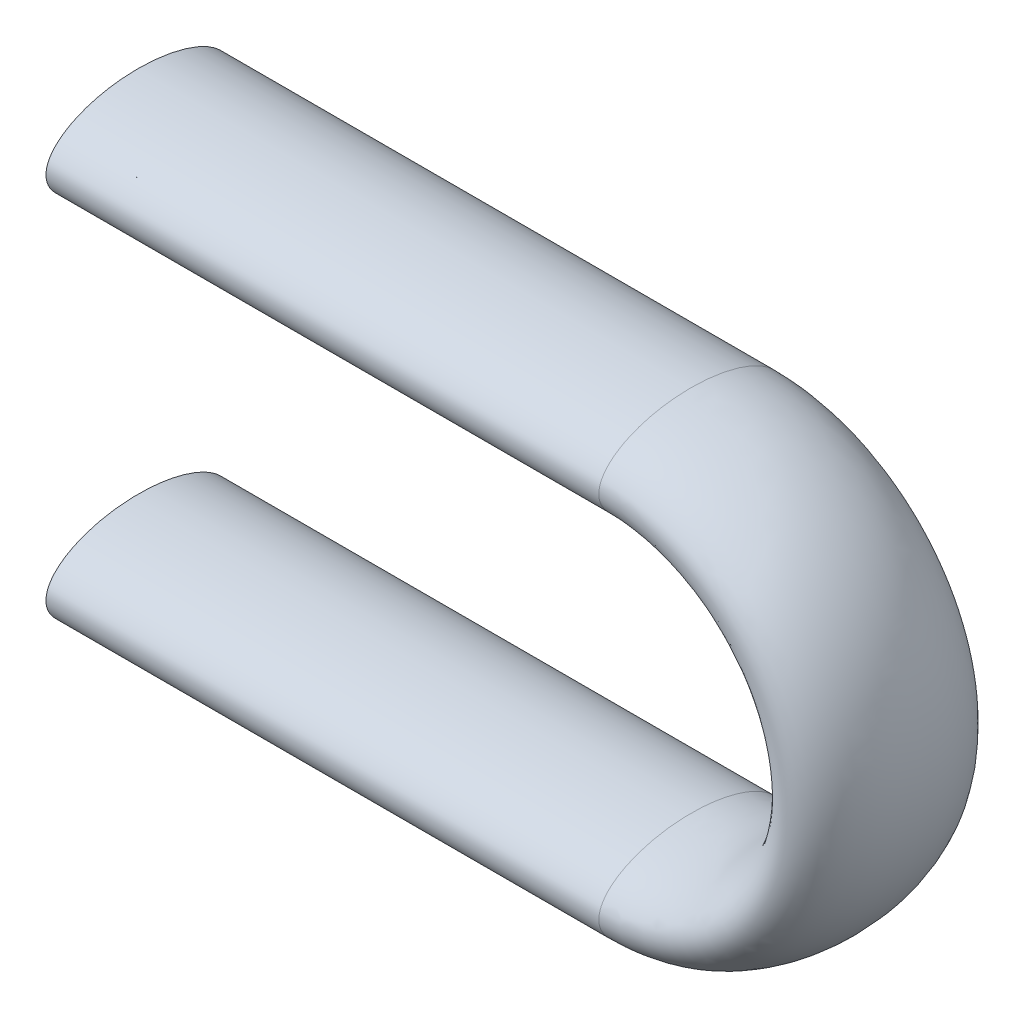
ISO-10303-21;
HEADER;
FILE_DESCRIPTION(('STEP AP214'),'2;1');
FILE_NAME('part.step','',(''),(''),'','','');
FILE_SCHEMA(('AUTOMOTIVE_DESIGN { 1 0 10303 214 1 1 1 1 }'));
ENDSEC;
DATA;
#1=APPLICATION_CONTEXT('core data for automotive mechanical design processes');
#2=APPLICATION_PROTOCOL_DEFINITION('international standard','automotive_design',2000,#1);
#3=PRODUCT_CONTEXT('',#1,'mechanical');
#4=PRODUCT('Part','Part','',(#3));
#5=PRODUCT_RELATED_PRODUCT_CATEGORY('part','',(#4));
#6=PRODUCT_DEFINITION_FORMATION('','',#4);
#7=PRODUCT_DEFINITION_CONTEXT('part definition',#1,'design');
#8=PRODUCT_DEFINITION('design','',#6,#7);
#9=PRODUCT_DEFINITION_SHAPE('','',#8);
#10=(LENGTH_UNIT() NAMED_UNIT(*) SI_UNIT(.MILLI.,.METRE.));
#11=(NAMED_UNIT(*) PLANE_ANGLE_UNIT() SI_UNIT($,.RADIAN.));
#12=(NAMED_UNIT(*) SI_UNIT($,.STERADIAN.) SOLID_ANGLE_UNIT());
#13=UNCERTAINTY_MEASURE_WITH_UNIT(LENGTH_MEASURE(1.E-05),#10,'distance_accuracy_value','');
#14=(GEOMETRIC_REPRESENTATION_CONTEXT(3) GLOBAL_UNCERTAINTY_ASSIGNED_CONTEXT((#13)) GLOBAL_UNIT_ASSIGNED_CONTEXT((#10,
#11,#12)) REPRESENTATION_CONTEXT('',''));
#15=CARTESIAN_POINT('',(0.,0.,0.));
#16=DIRECTION('',(0.,0.,1.));
#17=DIRECTION('',(1.,0.,0.));
#18=AXIS2_PLACEMENT_3D('',#15,#16,#17);
#19=CARTESIAN_POINT('',(0.,203.2,0.));
#20=DIRECTION('',(-1.,0.,0.));
#21=DIRECTION('',(0.,0.,-1.));
#22=AXIS2_PLACEMENT_3D('',#19,#20,#21);
#23=PLANE('',#22);
#24=CARTESIAN_POINT('',(0.,203.2,0.));
#25=DIRECTION('',(-1.,0.,0.));
#26=DIRECTION('',(0.,-1.,0.));
#27=AXIS2_PLACEMENT_3D('',#24,#25,#26);
#28=CIRCLE('',#27,19.05);
#29=CARTESIAN_POINT('',(0.,184.15,0.));
#30=VERTEX_POINT('',#29);
#31=EDGE_CURVE('E51',#30,#30,#28,.F.);
#32=ORIENTED_EDGE('',*,*,#31,.T.);
#33=EDGE_LOOP('',(#32));
#34=FACE_BOUND('',#33,.T.);
#35=CARTESIAN_POINT('',(0.,203.2,0.));
#36=DIRECTION('',(-1.,0.,0.));
#37=DIRECTION('',(0.,0.,-1.));
#38=AXIS2_PLACEMENT_3D('',#35,#36,#37);
#39=ELLIPSE('',#38,50.8,25.4);
#40=CARTESIAN_POINT('',(0.,203.2,-50.8));
#41=VERTEX_POINT('',#40);
#42=EDGE_CURVE('E45',#41,#41,#39,.T.);
#43=ORIENTED_EDGE('',*,*,#42,.T.);
#44=EDGE_LOOP('',(#43));
#45=FACE_BOUND('',#44,.T.);
#46=ADVANCED_FACE('F31',(#34,#45),#23,.T.);
#47=CARTESIAN_POINT('',(0.,0.,0.));
#48=DIRECTION('',(1.,0.,0.));
#49=DIRECTION('',(0.,0.,-1.));
#50=AXIS2_PLACEMENT_3D('',#47,#48,#49);
#51=PLANE('',#50);
#52=CARTESIAN_POINT('',(0.,0.,0.));
#53=DIRECTION('',(1.,0.,0.));
#54=DIRECTION('',(0.,0.,-1.));
#55=AXIS2_PLACEMENT_3D('',#52,#53,#54);
#56=CIRCLE('',#55,19.05);
#57=CARTESIAN_POINT('',(0.,0.,-19.05));
#58=VERTEX_POINT('',#57);
#59=EDGE_CURVE('E50',#58,#58,#56,.F.);
#60=ORIENTED_EDGE('',*,*,#59,.F.);
#61=EDGE_LOOP('',(#60));
#62=FACE_BOUND('',#61,.T.);
#63=CARTESIAN_POINT('',(0.,0.,0.));
#64=DIRECTION('',(1.,0.,0.));
#65=DIRECTION('',(0.,0.,-1.));
#66=AXIS2_PLACEMENT_3D('',#63,#64,#65);
#67=ELLIPSE('',#66,50.8,25.4);
#68=CARTESIAN_POINT('',(0.,0.,-50.8));
#69=VERTEX_POINT('',#68);
#70=EDGE_CURVE('E10',#69,#69,#67,.T.);
#71=ORIENTED_EDGE('',*,*,#70,.F.);
#72=EDGE_LOOP('',(#71));
#73=FACE_BOUND('',#72,.T.);
#74=ADVANCED_FACE('F93',(#62,#73),#51,.F.);
#75=CARTESIAN_POINT('',(0.,203.2,-50.8));
#76=CARTESIAN_POINT('',(304.8,203.2,-50.8));
#77=CARTESIAN_POINT('',(0.,152.4,-50.8));
#78=CARTESIAN_POINT('',(304.8,152.4,-50.8));
#79=CARTESIAN_POINT('',(0.,152.4,50.8));
#80=CARTESIAN_POINT('',(304.8,152.4,50.8));
#81=CARTESIAN_POINT('',(0.,203.2,50.8));
#82=CARTESIAN_POINT('',(304.8,203.2,50.8));
#83=CARTESIAN_POINT('',(0.,254.,50.8));
#84=CARTESIAN_POINT('',(304.8,254.,50.8));
#85=CARTESIAN_POINT('',(0.,254.,-50.8));
#86=CARTESIAN_POINT('',(304.8,254.,-50.8));
#87=CARTESIAN_POINT('',(0.,203.2,-50.8));
#88=CARTESIAN_POINT('',(304.8,203.2,-50.8));
#89=(BOUNDED_SURFACE() B_SPLINE_SURFACE(3,1,((#75,#76),(#77,#78),(#79,#80),(#81,#82),(#83,#84),
(#85,#86),(#87,#88)),.UNSPECIFIED.,.T.,.F.,.F.) B_SPLINE_SURFACE_WITH_KNOTS((4,3,4),(2,2),(0.,
0.5,1.),(0.,1.),.UNSPECIFIED.) GEOMETRIC_REPRESENTATION_ITEM() RATIONAL_B_SPLINE_SURFACE(((1.,
1.),(0.333333333333333,0.333333333333333),(0.333333333333333,0.333333333333333),(1.,1.),
(0.333333333333333,0.333333333333333),(0.333333333333333,0.333333333333333),(1.,1.))) REPRESENTATION_ITEM('') SURFACE());
#90=CARTESIAN_POINT('',(304.8,203.2,0.));
#91=DIRECTION('',(-1.,0.,0.));
#92=DIRECTION('',(0.,0.,-1.));
#93=AXIS2_PLACEMENT_3D('',#90,#91,#92);
#94=ELLIPSE('',#93,50.8,25.4);
#95=CARTESIAN_POINT('',(304.8,203.2,-50.8));
#96=VERTEX_POINT('',#95);
#97=EDGE_CURVE('E41',#96,#96,#94,.T.);
#98=ORIENTED_EDGE('',*,*,#97,.T.);
#99=EDGE_LOOP('',(#98));
#100=FACE_BOUND('',#99,.T.);
#101=ORIENTED_EDGE('',*,*,#42,.F.);
#102=EDGE_LOOP('',(#101));
#103=FACE_BOUND('',#102,.T.);
#104=ADVANCED_FACE('F85',(#100,#103),#89,.F.);
#105=CARTESIAN_POINT('',(304.8,203.2,-50.8));
#106=CARTESIAN_POINT('',(508.,203.2,-50.8));
#107=CARTESIAN_POINT('',(508.,1.11022302462516E-13,-50.8));
#108=CARTESIAN_POINT('',(304.8,0.,-50.8));
#109=CARTESIAN_POINT('',(304.8,152.4,-50.8));
#110=CARTESIAN_POINT('',(406.4,152.4,-50.8));
#111=CARTESIAN_POINT('',(406.4,50.8,-50.8));
#112=CARTESIAN_POINT('',(304.8,50.8,-50.8));
#113=CARTESIAN_POINT('',(304.8,152.4,50.8));
#114=CARTESIAN_POINT('',(406.4,152.4,50.8));
#115=CARTESIAN_POINT('',(406.4,50.8,50.8));
#116=CARTESIAN_POINT('',(304.8,50.8,50.8));
#117=CARTESIAN_POINT('',(304.8,203.2,50.8));
#118=CARTESIAN_POINT('',(508.,203.2,50.8));
#119=CARTESIAN_POINT('',(508.,1.11022302462516E-13,50.8));
#120=CARTESIAN_POINT('',(304.8,0.,50.8));
#121=CARTESIAN_POINT('',(304.8,254.,50.8));
#122=CARTESIAN_POINT('',(609.6,254.,50.8));
#123=CARTESIAN_POINT('',(609.6,-50.7999999999997,50.8));
#124=CARTESIAN_POINT('',(304.8,-50.8,50.8));
#125=CARTESIAN_POINT('',(304.8,254.,-50.8));
#126=CARTESIAN_POINT('',(609.6,254.,-50.8));
#127=CARTESIAN_POINT('',(609.6,-50.7999999999997,-50.8));
#128=CARTESIAN_POINT('',(304.8,-50.8,-50.8));
#129=CARTESIAN_POINT('',(304.8,203.2,-50.8));
#130=CARTESIAN_POINT('',(508.,203.2,-50.8));
#131=CARTESIAN_POINT('',(508.,1.11022302462516E-13,-50.8));
#132=CARTESIAN_POINT('',(304.8,0.,-50.8));
#133=(BOUNDED_SURFACE() B_SPLINE_SURFACE(3,3,((#105,#106,#107,#108),(#109,#110,#111,#112),(#113,
#114,#115,#116),(#117,#118,#119,#120),(#121,#122,#123,#124),(#125,#126,#127,#128),(#129,#130,
#131,#132)),.UNSPECIFIED.,.T.,.F.,.F.) B_SPLINE_SURFACE_WITH_KNOTS((4,3,4),(4,4),(0.,0.5,1.),
(0.,1.),.UNSPECIFIED.) GEOMETRIC_REPRESENTATION_ITEM() RATIONAL_B_SPLINE_SURFACE(((1.,
0.333333333333333,0.333333333333333,1.),(0.333333333333333,0.111111111111111,0.111111111111111,
0.333333333333333),(0.333333333333333,0.111111111111111,0.111111111111111,0.333333333333333),
(1.,0.333333333333333,0.333333333333333,1.),(0.333333333333333,0.111111111111111,
0.111111111111111,0.333333333333333),(0.333333333333333,0.111111111111111,0.111111111111111,
0.333333333333333),(1.,0.333333333333333,0.333333333333333,1.))) REPRESENTATION_ITEM('') SURFACE());
#134=CARTESIAN_POINT('',(304.8,0.,0.));
#135=DIRECTION('',(1.,0.,0.));
#136=DIRECTION('',(0.,0.,-1.));
#137=AXIS2_PLACEMENT_3D('',#134,#135,#136);
#138=ELLIPSE('',#137,50.8,25.4);
#139=CARTESIAN_POINT('',(304.8,0.,-50.8));
#140=VERTEX_POINT('',#139);
#141=EDGE_CURVE('E37',#140,#140,#138,.T.);
#142=ORIENTED_EDGE('',*,*,#141,.T.);
#143=EDGE_LOOP('',(#142));
#144=FACE_BOUND('',#143,.T.);
#145=ORIENTED_EDGE('',*,*,#97,.F.);
#146=EDGE_LOOP('',(#145));
#147=FACE_BOUND('',#146,.T.);
#148=ADVANCED_FACE('F80',(#144,#147),#133,.F.);
#149=CARTESIAN_POINT('',(304.8,0.,-50.8));
#150=CARTESIAN_POINT('',(0.,0.,-50.8));
#151=CARTESIAN_POINT('',(304.8,50.8,-50.8));
#152=CARTESIAN_POINT('',(0.,50.8,-50.8));
#153=CARTESIAN_POINT('',(304.8,50.8,50.8));
#154=CARTESIAN_POINT('',(0.,50.8,50.8));
#155=CARTESIAN_POINT('',(304.8,0.,50.8));
#156=CARTESIAN_POINT('',(0.,0.,50.8));
#157=CARTESIAN_POINT('',(304.8,-50.8,50.8));
#158=CARTESIAN_POINT('',(0.,-50.8,50.8));
#159=CARTESIAN_POINT('',(304.8,-50.8,-50.8));
#160=CARTESIAN_POINT('',(0.,-50.8,-50.8));
#161=CARTESIAN_POINT('',(304.8,0.,-50.8));
#162=CARTESIAN_POINT('',(0.,0.,-50.8));
#163=(BOUNDED_SURFACE() B_SPLINE_SURFACE(3,1,((#149,#150),(#151,#152),(#153,#154),(#155,#156),
(#157,#158),(#159,#160),(#161,#162)),.UNSPECIFIED.,.T.,.F.,.F.) B_SPLINE_SURFACE_WITH_KNOTS((4,
3,4),(2,2),(0.,0.5,1.),(0.,1.),
.UNSPECIFIED.) GEOMETRIC_REPRESENTATION_ITEM() RATIONAL_B_SPLINE_SURFACE(((1.,1.),
(0.333333333333333,0.333333333333333),(0.333333333333333,0.333333333333333),(1.,1.),
(0.333333333333333,0.333333333333333),(0.333333333333333,0.333333333333333),(1.,1.))) REPRESENTATION_ITEM('') SURFACE());
#164=ORIENTED_EDGE('',*,*,#70,.T.);
#165=EDGE_LOOP('',(#164));
#166=FACE_BOUND('',#165,.T.);
#167=ORIENTED_EDGE('',*,*,#141,.F.);
#168=EDGE_LOOP('',(#167));
#169=FACE_BOUND('',#168,.T.);
#170=ADVANCED_FACE('F77',(#166,#169),#163,.F.);
#171=CARTESIAN_POINT('',(-3.04800000000003,203.2,0.));
#172=DIRECTION('',(1.,0.,0.));
#173=DIRECTION('',(0.,1.,0.));
#174=AXIS2_PLACEMENT_3D('',#171,#172,#173);
#175=CYLINDRICAL_SURFACE('',#174,19.05);
#176=CARTESIAN_POINT('',(304.8,203.2,0.));
#177=DIRECTION('',(1.,0.,0.));
#178=DIRECTION('',(0.,0.,1.));
#179=AXIS2_PLACEMENT_3D('',#176,#177,#178);
#180=CIRCLE('',#179,19.05);
#181=CARTESIAN_POINT('',(304.8,222.25,0.));
#182=VERTEX_POINT('',#181);
#183=EDGE_CURVE('E54',#182,#182,#180,.T.);
#184=ORIENTED_EDGE('',*,*,#183,.T.);
#185=EDGE_LOOP('',(#184));
#186=FACE_BOUND('',#185,.T.);
#187=ORIENTED_EDGE('',*,*,#31,.F.);
#188=EDGE_LOOP('',(#187));
#189=FACE_BOUND('',#188,.T.);
#190=ADVANCED_FACE('F63',(#186,#189),#175,.F.);
#191=CARTESIAN_POINT('',(304.8,101.6,0.));
#192=DIRECTION('',(0.,0.,-1.));
#193=DIRECTION('',(-1.,0.,0.));
#194=AXIS2_PLACEMENT_3D('',#191,#192,#193);
#195=TOROIDAL_SURFACE('',#194,101.6,19.05);
#196=CARTESIAN_POINT('',(304.8,0.,0.));
#197=DIRECTION('',(-1.,0.,0.));
#198=DIRECTION('',(0.,0.,1.));
#199=AXIS2_PLACEMENT_3D('',#196,#197,#198);
#200=CIRCLE('',#199,19.05);
#201=CARTESIAN_POINT('',(304.8,-19.05,0.));
#202=VERTEX_POINT('',#201);
#203=EDGE_CURVE('E57',#202,#202,#200,.T.);
#204=CARTESIAN_POINT('',(304.8,101.6,0.));
#205=DIRECTION('',(0.,0.,-1.));
#206=DIRECTION('',(-1.,0.,0.));
#207=AXIS2_PLACEMENT_3D('',#204,#205,#206);
#208=CIRCLE('',#207,120.65);
#209=EDGE_CURVE('',#182,#202,#208,.T.);
#210=ORIENTED_EDGE('',*,*,#183,.F.);
#211=ORIENTED_EDGE('',*,*,#203,.T.);
#212=ORIENTED_EDGE('',*,*,#209,.T.);
#213=ORIENTED_EDGE('',*,*,#209,.F.);
#214=EDGE_LOOP('',(#210,#212,#211,#213));
#215=FACE_BOUND('',#214,.T.);
#216=ADVANCED_FACE('F66',(#215),#195,.F.);
#217=CARTESIAN_POINT('',(304.8,0.,0.));
#218=DIRECTION('',(-1.,0.,0.));
#219=DIRECTION('',(0.,0.,1.));
#220=AXIS2_PLACEMENT_3D('',#217,#218,#219);
#221=CYLINDRICAL_SURFACE('',#220,19.05);
#222=ORIENTED_EDGE('',*,*,#59,.T.);
#223=EDGE_LOOP('',(#222));
#224=FACE_BOUND('',#223,.T.);
#225=ORIENTED_EDGE('',*,*,#203,.F.);
#226=EDGE_LOOP('',(#225));
#227=FACE_BOUND('',#226,.T.);
#228=ADVANCED_FACE('F68',(#224,#227),#221,.F.);
#229=CLOSED_SHELL('',(#46,#74,#104,#148,#170,#190,#216,#228));
#230=MANIFOLD_SOLID_BREP('B2',#229);
#231=ADVANCED_BREP_SHAPE_REPRESENTATION('',(#18,#230),#14);
#232=SHAPE_DEFINITION_REPRESENTATION(#9,#231);
ENDSEC;
END-ISO-10303-21;
